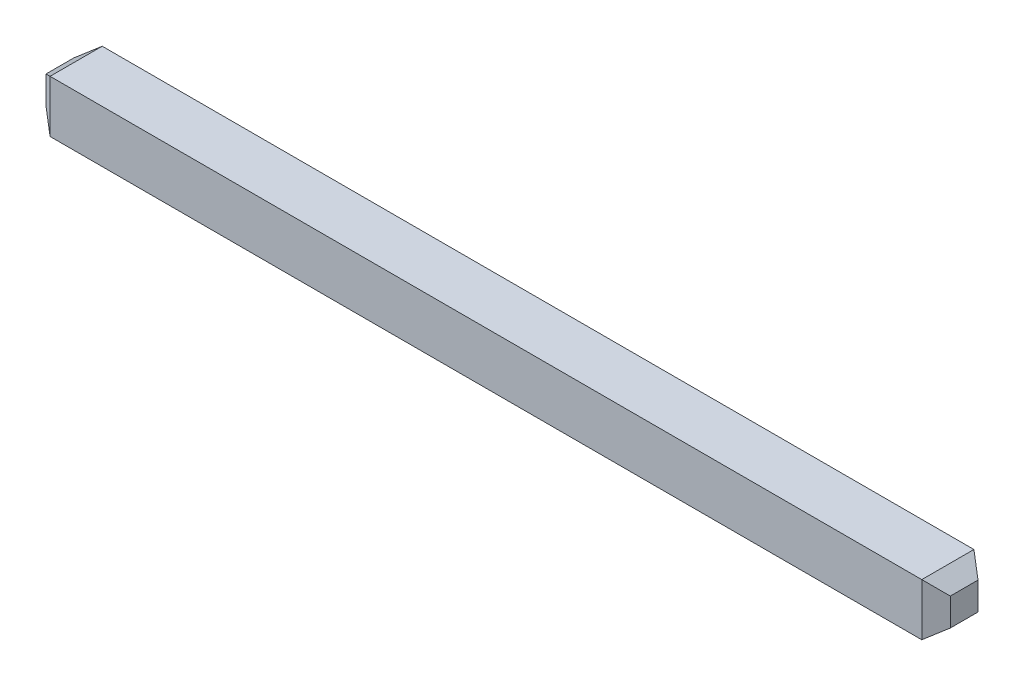
ISO-10303-21;
HEADER;
FILE_DESCRIPTION(('STEP AP214'),'2;1');
FILE_NAME('part.step','',(''),(''),'','','');
FILE_SCHEMA(('AUTOMOTIVE_DESIGN { 1 0 10303 214 1 1 1 1 }'));
ENDSEC;
DATA;
#1=APPLICATION_CONTEXT('core data for automotive mechanical design processes');
#2=APPLICATION_PROTOCOL_DEFINITION('international standard','automotive_design',2000,#1);
#3=PRODUCT_CONTEXT('',#1,'mechanical');
#4=PRODUCT('Part','Part','',(#3));
#5=PRODUCT_RELATED_PRODUCT_CATEGORY('part','',(#4));
#6=PRODUCT_DEFINITION_FORMATION('','',#4);
#7=PRODUCT_DEFINITION_CONTEXT('part definition',#1,'design');
#8=PRODUCT_DEFINITION('design','',#6,#7);
#9=PRODUCT_DEFINITION_SHAPE('','',#8);
#10=(LENGTH_UNIT() NAMED_UNIT(*) SI_UNIT(.MILLI.,.METRE.));
#11=(NAMED_UNIT(*) PLANE_ANGLE_UNIT() SI_UNIT($,.RADIAN.));
#12=(NAMED_UNIT(*) SI_UNIT($,.STERADIAN.) SOLID_ANGLE_UNIT());
#13=UNCERTAINTY_MEASURE_WITH_UNIT(LENGTH_MEASURE(1.E-05),#10,'distance_accuracy_value','');
#14=(GEOMETRIC_REPRESENTATION_CONTEXT(3) GLOBAL_UNCERTAINTY_ASSIGNED_CONTEXT((#13)) GLOBAL_UNIT_ASSIGNED_CONTEXT((#10,
#11,#12)) REPRESENTATION_CONTEXT('',''));
#15=CARTESIAN_POINT('',(0.,0.,0.));
#16=DIRECTION('',(0.,0.,1.));
#17=DIRECTION('',(1.,0.,0.));
#18=AXIS2_PLACEMENT_3D('',#15,#16,#17);
#19=CARTESIAN_POINT('',(-2.4,3.525,-49.53));
#20=DIRECTION('',(0.6,0.8,0.));
#21=DIRECTION('',(-0.8,0.6,0.));
#22=AXIS2_PLACEMENT_3D('',#19,#20,#21);
#23=PLANE('',#22);
#24=DIRECTION('',(0.,0.,1.));
#25=VECTOR('',#24,1.);
#26=CARTESIAN_POINT('',(-2.3,3.45,-49.53));
#27=LINE('',#26,#25);
#28=CARTESIAN_POINT('',(-2.29999999999978,3.45,-49.8499999999997));
#29=VERTEX_POINT('',#28);
#30=CARTESIAN_POINT('',(-2.29999999999979,3.45,-49.2100000000003));
#31=VERTEX_POINT('',#30);
#32=EDGE_CURVE('E105',#29,#31,#27,.T.);
#33=ORIENTED_EDGE('',*,*,#32,.T.);
#34=DIRECTION('',(0.685994340575951,-0.514495755427526,0.514495755419639));
#35=VECTOR('',#34,1.);
#36=CARTESIAN_POINT('',(-2.50000000000087,3.6,-49.3599999999988));
#37=LINE('',#36,#35);
#38=CARTESIAN_POINT('',(-2.50000000000022,3.6,-49.3599999999997));
#39=VERTEX_POINT('',#38);
#40=EDGE_CURVE('E92',#39,#31,#37,.T.);
#41=ORIENTED_EDGE('',*,*,#40,.F.);
#42=DIRECTION('',(0.,0.,-1.));
#43=VECTOR('',#42,1.);
#44=CARTESIAN_POINT('',(-2.5,3.6,-49.53));
#45=LINE('',#44,#43);
#46=CARTESIAN_POINT('',(-2.50000000000043,3.6,-49.7000000000006));
#47=VERTEX_POINT('',#46);
#48=EDGE_CURVE('E79',#39,#47,#45,.T.);
#49=ORIENTED_EDGE('',*,*,#48,.T.);
#50=DIRECTION('',(0.685994340575995,-0.514495755427521,-0.514495755419586));
#51=VECTOR('',#50,1.);
#52=CARTESIAN_POINT('',(-2.50000000000087,3.6,-49.7000000000012));
#53=LINE('',#52,#51);
#54=EDGE_CURVE('E20',#47,#29,#53,.T.);
#55=ORIENTED_EDGE('',*,*,#54,.T.);
#56=EDGE_LOOP('',(#33,#41,#49,#55));
#57=FACE_BOUND('',#56,.T.);
#58=ADVANCED_FACE('F17',(#57),#23,.F.);
#59=CARTESIAN_POINT('',(8.5,3.525,-49.53));
#60=DIRECTION('',(-0.6,0.8,0.));
#61=DIRECTION('',(-0.8,-0.6,0.));
#62=AXIS2_PLACEMENT_3D('',#59,#60,#61);
#63=PLANE('',#62);
#64=DIRECTION('',(0.,0.,-1.));
#65=VECTOR('',#64,1.);
#66=CARTESIAN_POINT('',(8.6,3.6,-49.53));
#67=LINE('',#66,#65);
#68=CARTESIAN_POINT('',(8.60000000000043,3.6,-49.3599999999994));
#69=VERTEX_POINT('',#68);
#70=CARTESIAN_POINT('',(8.60000000000022,3.6,-49.7000000000003));
#71=VERTEX_POINT('',#70);
#72=EDGE_CURVE('E114',#69,#71,#67,.T.);
#73=ORIENTED_EDGE('',*,*,#72,.F.);
#74=DIRECTION('',(0.685994340575951,0.514495755427526,-0.514495755419639));
#75=VECTOR('',#74,1.);
#76=CARTESIAN_POINT('',(8.39999999999914,3.45,-49.2100000000012));
#77=LINE('',#76,#75);
#78=CARTESIAN_POINT('',(8.39999999999989,3.45,-49.2100000000001));
#79=VERTEX_POINT('',#78);
#80=EDGE_CURVE('E109',#79,#69,#77,.T.);
#81=ORIENTED_EDGE('',*,*,#80,.F.);
#82=DIRECTION('',(0.,0.,1.));
#83=VECTOR('',#82,1.);
#84=CARTESIAN_POINT('',(8.4,3.45,-49.53));
#85=LINE('',#84,#83);
#86=CARTESIAN_POINT('',(8.39999999999978,3.45,-49.8499999999997));
#87=VERTEX_POINT('',#86);
#88=EDGE_CURVE('E103',#79,#87,#85,.F.);
#89=ORIENTED_EDGE('',*,*,#88,.T.);
#90=DIRECTION('',(0.685994340575993,0.514495755427522,0.514495755419587));
#91=VECTOR('',#90,1.);
#92=CARTESIAN_POINT('',(8.39999999999913,3.45,-49.8499999999988));
#93=LINE('',#92,#91);
#94=EDGE_CURVE('E107',#87,#71,#93,.T.);
#95=ORIENTED_EDGE('',*,*,#94,.T.);
#96=EDGE_LOOP('',(#73,#81,#89,#95));
#97=FACE_BOUND('',#96,.T.);
#98=ADVANCED_FACE('F175',(#97),#63,.F.);
#99=CARTESIAN_POINT('',(-2.4,3.77,-49.775));
#100=DIRECTION('',(0.599999999990736,0.,0.800000000006948));
#101=DIRECTION('',(0.800000000006948,0.,-0.599999999990736));
#102=AXIS2_PLACEMENT_3D('',#99,#100,#101);
#103=PLANE('',#102);
#104=DIRECTION('',(0.,1.,0.));
#105=VECTOR('',#104,1.);
#106=CARTESIAN_POINT('',(-2.3,3.77,-49.85));
#107=LINE('',#106,#105);
#108=CARTESIAN_POINT('',(-2.29999999999956,4.09,-49.8499999999994));
#109=VERTEX_POINT('',#108);
#110=EDGE_CURVE('E88',#109,#29,#107,.F.);
#111=ORIENTED_EDGE('',*,*,#110,.T.);
#112=ORIENTED_EDGE('',*,*,#54,.F.);
#113=DIRECTION('',(0.,1.,0.));
#114=VECTOR('',#113,1.);
#115=CARTESIAN_POINT('',(-2.5,3.77,-49.7));
#116=LINE('',#115,#114);
#117=CARTESIAN_POINT('',(-2.50000000000043,3.94,-49.7000000000006));
#118=VERTEX_POINT('',#117);
#119=EDGE_CURVE('E85',#47,#118,#116,.T.);
#120=ORIENTED_EDGE('',*,*,#119,.T.);
#121=DIRECTION('',(-0.68599434057003,-0.514495755427522,0.514495755427537));
#122=VECTOR('',#121,1.);
#123=CARTESIAN_POINT('',(-2.3,4.09,-49.85));
#124=LINE('',#123,#122);
#125=EDGE_CURVE('E126',#109,#118,#124,.T.);
#126=ORIENTED_EDGE('',*,*,#125,.F.);
#127=EDGE_LOOP('',(#111,#112,#120,#126));
#128=FACE_BOUND('',#127,.T.);
#129=ADVANCED_FACE('F84',(#128),#103,.F.);
#130=CARTESIAN_POINT('',(-2.5,3.77,-49.53));
#131=DIRECTION('',(1.,0.,0.));
#132=DIRECTION('',(0.,0.,-1.));
#133=AXIS2_PLACEMENT_3D('',#130,#131,#132);
#134=PLANE('',#133);
#135=DIRECTION('',(0.,1.,0.));
#136=VECTOR('',#135,1.);
#137=CARTESIAN_POINT('',(-2.50000000000087,3.77,-49.3599999999988));
#138=LINE('',#137,#136);
#139=CARTESIAN_POINT('',(-2.50000000000022,3.94,-49.3599999999997));
#140=VERTEX_POINT('',#139);
#141=EDGE_CURVE('E94',#140,#39,#138,.F.);
#142=ORIENTED_EDGE('',*,*,#141,.F.);
#143=DIRECTION('',(0.,0.,1.));
#144=VECTOR('',#143,1.);
#145=CARTESIAN_POINT('',(-2.5,3.94,-49.53));
#146=LINE('',#145,#144);
#147=EDGE_CURVE('E98',#118,#140,#146,.T.);
#148=ORIENTED_EDGE('',*,*,#147,.F.);
#149=ORIENTED_EDGE('',*,*,#119,.F.);
#150=ORIENTED_EDGE('',*,*,#48,.F.);
#151=EDGE_LOOP('',(#142,#148,#149,#150));
#152=FACE_BOUND('',#151,.T.);
#153=ADVANCED_FACE('F96',(#152),#134,.F.);
#154=CARTESIAN_POINT('',(-2.4,3.77,-49.285));
#155=DIRECTION('',(-0.5999999999908,0.,0.8000000000069));
#156=DIRECTION('',(0.8000000000069,0.,0.5999999999908));
#157=AXIS2_PLACEMENT_3D('',#154,#155,#156);
#158=PLANE('',#157);
#159=ORIENTED_EDGE('',*,*,#40,.T.);
#160=DIRECTION('',(0.,1.,0.));
#161=VECTOR('',#160,1.);
#162=CARTESIAN_POINT('',(-2.3,3.77,-49.21));
#163=LINE('',#162,#161);
#164=CARTESIAN_POINT('',(-2.29999999999957,4.09,-49.2100000000006));
#165=VERTEX_POINT('',#164);
#166=EDGE_CURVE('E132',#165,#31,#163,.F.);
#167=ORIENTED_EDGE('',*,*,#166,.F.);
#168=DIRECTION('',(0.685994340570039,0.514495755427529,0.51449575542752));
#169=VECTOR('',#168,1.);
#170=CARTESIAN_POINT('',(-2.5,3.94,-49.36));
#171=LINE('',#170,#169);
#172=EDGE_CURVE('E129',#140,#165,#171,.T.);
#173=ORIENTED_EDGE('',*,*,#172,.F.);
#174=ORIENTED_EDGE('',*,*,#141,.T.);
#175=EDGE_LOOP('',(#159,#167,#173,#174));
#176=FACE_BOUND('',#175,.T.);
#177=ADVANCED_FACE('F186',(#176),#158,.T.);
#178=CARTESIAN_POINT('',(3.05,3.45,-49.53));
#179=DIRECTION('',(0.,1.,0.));
#180=DIRECTION('',(0.,0.,1.));
#181=AXIS2_PLACEMENT_3D('',#178,#179,#180);
#182=PLANE('',#181);
#183=ORIENTED_EDGE('',*,*,#32,.F.);
#184=DIRECTION('',(1.,0.,0.));
#185=VECTOR('',#184,1.);
#186=CARTESIAN_POINT('',(3.05,3.45,-49.85));
#187=LINE('',#186,#185);
#188=EDGE_CURVE('E123',#29,#87,#187,.T.);
#189=ORIENTED_EDGE('',*,*,#188,.T.);
#190=ORIENTED_EDGE('',*,*,#88,.F.);
#191=DIRECTION('',(1.,0.,0.));
#192=VECTOR('',#191,1.);
#193=CARTESIAN_POINT('',(3.05,3.45,-49.21));
#194=LINE('',#193,#192);
#195=EDGE_CURVE('E135',#31,#79,#194,.T.);
#196=ORIENTED_EDGE('',*,*,#195,.F.);
#197=EDGE_LOOP('',(#183,#189,#190,#196));
#198=FACE_BOUND('',#197,.T.);
#199=ADVANCED_FACE('F179',(#198),#182,.F.);
#200=CARTESIAN_POINT('',(8.5,3.77,-49.775));
#201=DIRECTION('',(-0.599999999990736,0.,0.800000000006948));
#202=DIRECTION('',(0.800000000006948,0.,0.599999999990736));
#203=AXIS2_PLACEMENT_3D('',#200,#201,#202);
#204=PLANE('',#203);
#205=DIRECTION('',(0.,1.,0.));
#206=VECTOR('',#205,1.);
#207=CARTESIAN_POINT('',(8.6,3.77,-49.7));
#208=LINE('',#207,#206);
#209=CARTESIAN_POINT('',(8.60000000000043,3.94,-49.7000000000006));
#210=VERTEX_POINT('',#209);
#211=EDGE_CURVE('E117',#71,#210,#208,.T.);
#212=ORIENTED_EDGE('',*,*,#211,.F.);
#213=ORIENTED_EDGE('',*,*,#94,.F.);
#214=DIRECTION('',(0.,1.,0.));
#215=VECTOR('',#214,1.);
#216=CARTESIAN_POINT('',(8.4,3.77,-49.85));
#217=LINE('',#216,#215);
#218=CARTESIAN_POINT('',(8.39999999999956,4.09,-49.8499999999994));
#219=VERTEX_POINT('',#218);
#220=EDGE_CURVE('E120',#87,#219,#217,.T.);
#221=ORIENTED_EDGE('',*,*,#220,.T.);
#222=DIRECTION('',(-0.685994340570029,0.514495755427522,-0.51449575542754));
#223=VECTOR('',#222,1.);
#224=CARTESIAN_POINT('',(8.6,3.94,-49.7));
#225=LINE('',#224,#223);
#226=EDGE_CURVE('E140',#210,#219,#225,.T.);
#227=ORIENTED_EDGE('',*,*,#226,.F.);
#228=EDGE_LOOP('',(#212,#213,#221,#227));
#229=FACE_BOUND('',#228,.T.);
#230=ADVANCED_FACE('F167',(#229),#204,.F.);
#231=CARTESIAN_POINT('',(8.5,3.77,-49.285));
#232=DIRECTION('',(0.5999999999908,0.,0.8000000000069));
#233=DIRECTION('',(0.8000000000069,0.,-0.5999999999908));
#234=AXIS2_PLACEMENT_3D('',#231,#232,#233);
#235=PLANE('',#234);
#236=DIRECTION('',(0.685994340570037,-0.514495755427528,-0.514495755427522));
#237=VECTOR('',#236,1.);
#238=CARTESIAN_POINT('',(8.4,4.09,-49.21));
#239=LINE('',#238,#237);
#240=CARTESIAN_POINT('',(8.39999999999957,4.09,-49.2100000000006));
#241=VERTEX_POINT('',#240);
#242=CARTESIAN_POINT('',(8.60000000000043,3.94,-49.3599999999994));
#243=VERTEX_POINT('',#242);
#244=EDGE_CURVE('E35',#241,#243,#239,.T.);
#245=ORIENTED_EDGE('',*,*,#244,.F.);
#246=DIRECTION('',(0.,1.,0.));
#247=VECTOR('',#246,1.);
#248=CARTESIAN_POINT('',(8.4,3.77,-49.21));
#249=LINE('',#248,#247);
#250=EDGE_CURVE('E138',#79,#241,#249,.T.);
#251=ORIENTED_EDGE('',*,*,#250,.F.);
#252=ORIENTED_EDGE('',*,*,#80,.T.);
#253=DIRECTION('',(0.,1.,0.));
#254=VECTOR('',#253,1.);
#255=CARTESIAN_POINT('',(8.6,3.77,-49.36));
#256=LINE('',#255,#254);
#257=EDGE_CURVE('E111',#243,#69,#256,.F.);
#258=ORIENTED_EDGE('',*,*,#257,.F.);
#259=EDGE_LOOP('',(#245,#251,#252,#258));
#260=FACE_BOUND('',#259,.T.);
#261=ADVANCED_FACE('F211',(#260),#235,.T.);
#262=CARTESIAN_POINT('',(8.6,3.77,-49.53));
#263=DIRECTION('',(1.,0.,0.));
#264=DIRECTION('',(0.,0.,-1.));
#265=AXIS2_PLACEMENT_3D('',#262,#263,#264);
#266=PLANE('',#265);
#267=ORIENTED_EDGE('',*,*,#211,.T.);
#268=DIRECTION('',(0.,0.,1.));
#269=VECTOR('',#268,1.);
#270=CARTESIAN_POINT('',(8.6,3.94,-49.53));
#271=LINE('',#270,#269);
#272=EDGE_CURVE('E144',#243,#210,#271,.F.);
#273=ORIENTED_EDGE('',*,*,#272,.F.);
#274=ORIENTED_EDGE('',*,*,#257,.T.);
#275=ORIENTED_EDGE('',*,*,#72,.T.);
#276=EDGE_LOOP('',(#267,#273,#274,#275));
#277=FACE_BOUND('',#276,.T.);
#278=ADVANCED_FACE('F172',(#277),#266,.T.);
#279=CARTESIAN_POINT('',(3.05,3.77,-49.85));
#280=DIRECTION('',(0.,0.,1.));
#281=DIRECTION('',(1.,0.,0.));
#282=AXIS2_PLACEMENT_3D('',#279,#280,#281);
#283=PLANE('',#282);
#284=ORIENTED_EDGE('',*,*,#110,.F.);
#285=DIRECTION('',(1.,0.,0.));
#286=VECTOR('',#285,1.);
#287=CARTESIAN_POINT('',(3.05,4.09,-49.85));
#288=LINE('',#287,#286);
#289=EDGE_CURVE('E147',#219,#109,#288,.F.);
#290=ORIENTED_EDGE('',*,*,#289,.F.);
#291=ORIENTED_EDGE('',*,*,#220,.F.);
#292=ORIENTED_EDGE('',*,*,#188,.F.);
#293=EDGE_LOOP('',(#284,#290,#291,#292));
#294=FACE_BOUND('',#293,.T.);
#295=ADVANCED_FACE('F181',(#294),#283,.F.);
#296=CARTESIAN_POINT('',(-2.4,4.015,-49.53));
#297=DIRECTION('',(-0.6,0.8,0.));
#298=DIRECTION('',(-0.8,-0.6,0.));
#299=AXIS2_PLACEMENT_3D('',#296,#297,#298);
#300=PLANE('',#299);
#301=ORIENTED_EDGE('',*,*,#172,.T.);
#302=DIRECTION('',(0.,0.,1.));
#303=VECTOR('',#302,1.);
#304=CARTESIAN_POINT('',(-2.3,4.09,-49.53));
#305=LINE('',#304,#303);
#306=EDGE_CURVE('E150',#109,#165,#305,.T.);
#307=ORIENTED_EDGE('',*,*,#306,.F.);
#308=ORIENTED_EDGE('',*,*,#125,.T.);
#309=ORIENTED_EDGE('',*,*,#147,.T.);
#310=EDGE_LOOP('',(#301,#307,#308,#309));
#311=FACE_BOUND('',#310,.T.);
#312=ADVANCED_FACE('F183',(#311),#300,.T.);
#313=CARTESIAN_POINT('',(3.05,3.77,-49.21));
#314=DIRECTION('',(0.,0.,1.));
#315=DIRECTION('',(1.,0.,0.));
#316=AXIS2_PLACEMENT_3D('',#313,#314,#315);
#317=PLANE('',#316);
#318=ORIENTED_EDGE('',*,*,#195,.T.);
#319=ORIENTED_EDGE('',*,*,#250,.T.);
#320=DIRECTION('',(1.,0.,0.));
#321=VECTOR('',#320,1.);
#322=CARTESIAN_POINT('',(3.05,4.09,-49.21));
#323=LINE('',#322,#321);
#324=EDGE_CURVE('E26',#165,#241,#323,.T.);
#325=ORIENTED_EDGE('',*,*,#324,.F.);
#326=ORIENTED_EDGE('',*,*,#166,.T.);
#327=EDGE_LOOP('',(#318,#319,#325,#326));
#328=FACE_BOUND('',#327,.T.);
#329=ADVANCED_FACE('F160',(#328),#317,.T.);
#330=CARTESIAN_POINT('',(8.5,4.015,-49.53));
#331=DIRECTION('',(0.6,0.8,0.));
#332=DIRECTION('',(-0.8,0.6,0.));
#333=AXIS2_PLACEMENT_3D('',#330,#331,#332);
#334=PLANE('',#333);
#335=ORIENTED_EDGE('',*,*,#244,.T.);
#336=ORIENTED_EDGE('',*,*,#272,.T.);
#337=ORIENTED_EDGE('',*,*,#226,.T.);
#338=DIRECTION('',(0.,0.,1.));
#339=VECTOR('',#338,1.);
#340=CARTESIAN_POINT('',(8.4,4.09,-49.53));
#341=LINE('',#340,#339);
#342=EDGE_CURVE('E11',#241,#219,#341,.F.);
#343=ORIENTED_EDGE('',*,*,#342,.F.);
#344=EDGE_LOOP('',(#335,#336,#337,#343));
#345=FACE_BOUND('',#344,.T.);
#346=ADVANCED_FACE('F163',(#345),#334,.T.);
#347=CARTESIAN_POINT('',(3.05,4.09,-49.53));
#348=DIRECTION('',(0.,1.,0.));
#349=DIRECTION('',(0.,0.,1.));
#350=AXIS2_PLACEMENT_3D('',#347,#348,#349);
#351=PLANE('',#350);
#352=ORIENTED_EDGE('',*,*,#324,.T.);
#353=ORIENTED_EDGE('',*,*,#342,.T.);
#354=ORIENTED_EDGE('',*,*,#289,.T.);
#355=ORIENTED_EDGE('',*,*,#306,.T.);
#356=EDGE_LOOP('',(#352,#353,#354,#355));
#357=FACE_BOUND('',#356,.T.);
#358=ADVANCED_FACE('F156',(#357),#351,.T.);
#359=CLOSED_SHELL('',(#58,#98,#129,#153,#177,#199,#230,#261,#278,#295,#312,#329,#346,#358));
#360=MANIFOLD_SOLID_BREP('B1',#359);
#361=ADVANCED_BREP_SHAPE_REPRESENTATION('',(#18,#360),#14);
#362=SHAPE_DEFINITION_REPRESENTATION(#9,#361);
ENDSEC;
END-ISO-10303-21;
